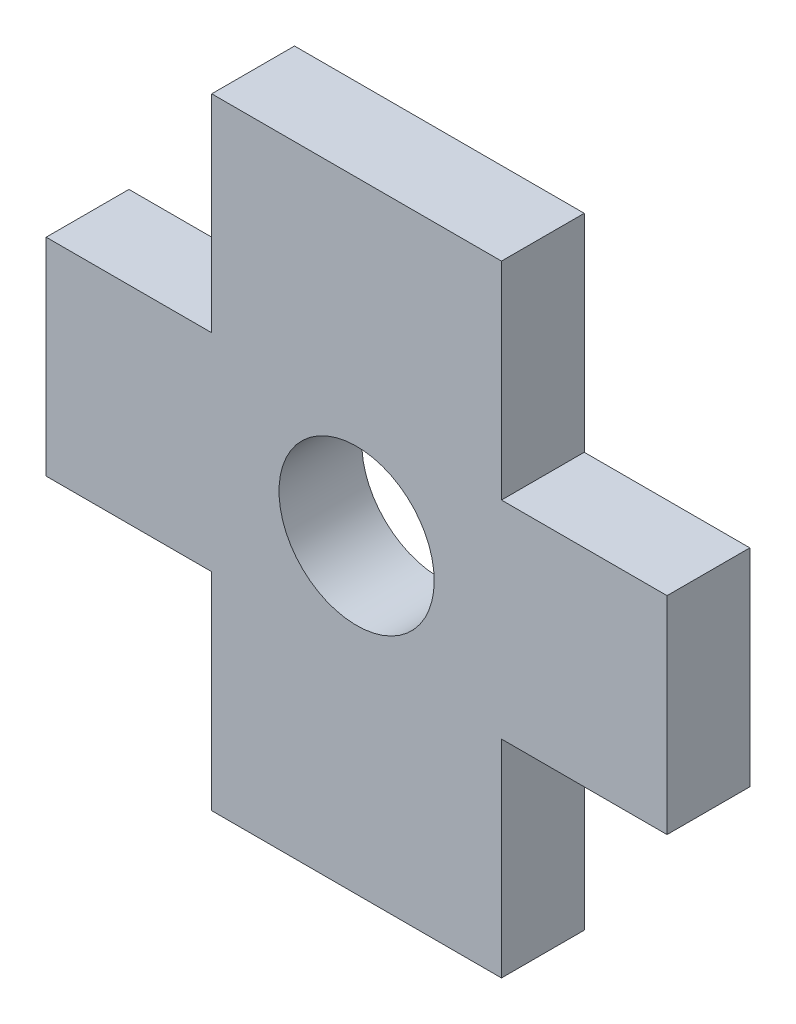
ISO-10303-21;
HEADER;
FILE_DESCRIPTION(('STEP AP214'),'2;1');
FILE_NAME('part.step','',(''),(''),'','','');
FILE_SCHEMA(('AUTOMOTIVE_DESIGN { 1 0 10303 214 1 1 1 1 }'));
ENDSEC;
DATA;
#1=APPLICATION_CONTEXT('core data for automotive mechanical design processes');
#2=APPLICATION_PROTOCOL_DEFINITION('international standard','automotive_design',2000,#1);
#3=PRODUCT_CONTEXT('',#1,'mechanical');
#4=PRODUCT('Part','Part','',(#3));
#5=PRODUCT_RELATED_PRODUCT_CATEGORY('part','',(#4));
#6=PRODUCT_DEFINITION_FORMATION('','',#4);
#7=PRODUCT_DEFINITION_CONTEXT('part definition',#1,'design');
#8=PRODUCT_DEFINITION('design','',#6,#7);
#9=PRODUCT_DEFINITION_SHAPE('','',#8);
#10=(LENGTH_UNIT() NAMED_UNIT(*) SI_UNIT(.MILLI.,.METRE.));
#11=(NAMED_UNIT(*) PLANE_ANGLE_UNIT() SI_UNIT($,.RADIAN.));
#12=(NAMED_UNIT(*) SI_UNIT($,.STERADIAN.) SOLID_ANGLE_UNIT());
#13=UNCERTAINTY_MEASURE_WITH_UNIT(LENGTH_MEASURE(1.E-05),#10,'distance_accuracy_value','');
#14=(GEOMETRIC_REPRESENTATION_CONTEXT(3) GLOBAL_UNCERTAINTY_ASSIGNED_CONTEXT((#13)) GLOBAL_UNIT_ASSIGNED_CONTEXT((#10,
#11,#12)) REPRESENTATION_CONTEXT('',''));
#15=CARTESIAN_POINT('',(0.,0.,0.));
#16=DIRECTION('',(0.,0.,1.));
#17=DIRECTION('',(1.,0.,0.));
#18=AXIS2_PLACEMENT_3D('',#15,#16,#17);
#19=CARTESIAN_POINT('',(0.,0.,1.6));
#20=DIRECTION('',(0.,0.,1.));
#21=DIRECTION('',(1.,0.,0.));
#22=AXIS2_PLACEMENT_3D('',#19,#20,#21);
#23=PLANE('',#22);
#24=DIRECTION('',(0.,-1.,0.));
#25=VECTOR('',#24,1.);
#26=CARTESIAN_POINT('',(-2.8,-2.,1.6));
#27=LINE('',#26,#25);
#28=CARTESIAN_POINT('',(-2.8,-2.,1.6));
#29=VERTEX_POINT('',#28);
#30=CARTESIAN_POINT('',(-2.8,-6.,1.6));
#31=VERTEX_POINT('',#30);
#32=EDGE_CURVE('E177',#29,#31,#27,.T.);
#33=ORIENTED_EDGE('',*,*,#32,.T.);
#34=DIRECTION('',(1.,0.,0.));
#35=VECTOR('',#34,1.);
#36=CARTESIAN_POINT('',(-2.8,-6.,1.6));
#37=LINE('',#36,#35);
#38=CARTESIAN_POINT('',(2.8,-6.,1.6));
#39=VERTEX_POINT('',#38);
#40=EDGE_CURVE('E105',#31,#39,#37,.T.);
#41=ORIENTED_EDGE('',*,*,#40,.T.);
#42=DIRECTION('',(0.,1.,0.));
#43=VECTOR('',#42,1.);
#44=CARTESIAN_POINT('',(2.8,-6.,1.6));
#45=LINE('',#44,#43);
#46=CARTESIAN_POINT('',(2.8,-2.,1.6));
#47=VERTEX_POINT('',#46);
#48=EDGE_CURVE('E204',#39,#47,#45,.T.);
#49=ORIENTED_EDGE('',*,*,#48,.T.);
#50=DIRECTION('',(1.,0.,0.));
#51=VECTOR('',#50,1.);
#52=CARTESIAN_POINT('',(2.8,-2.,1.6));
#53=LINE('',#52,#51);
#54=CARTESIAN_POINT('',(6.,-2.,1.6));
#55=VERTEX_POINT('',#54);
#56=EDGE_CURVE('E223',#47,#55,#53,.T.);
#57=ORIENTED_EDGE('',*,*,#56,.T.);
#58=DIRECTION('',(0.,1.,0.));
#59=VECTOR('',#58,1.);
#60=CARTESIAN_POINT('',(6.,-2.,1.6));
#61=LINE('',#60,#59);
#62=CARTESIAN_POINT('',(6.,2.,1.6));
#63=VERTEX_POINT('',#62);
#64=EDGE_CURVE('E220',#55,#63,#61,.T.);
#65=ORIENTED_EDGE('',*,*,#64,.T.);
#66=DIRECTION('',(-1.,0.,0.));
#67=VECTOR('',#66,1.);
#68=CARTESIAN_POINT('',(2.8,2.,1.6));
#69=LINE('',#68,#67);
#70=CARTESIAN_POINT('',(2.8,2.,1.6));
#71=VERTEX_POINT('',#70);
#72=EDGE_CURVE('E222',#63,#71,#69,.T.);
#73=ORIENTED_EDGE('',*,*,#72,.T.);
#74=DIRECTION('',(0.,1.,0.));
#75=VECTOR('',#74,1.);
#76=CARTESIAN_POINT('',(2.8,2.,1.6));
#77=LINE('',#76,#75);
#78=CARTESIAN_POINT('',(2.8,6.,1.6));
#79=VERTEX_POINT('',#78);
#80=EDGE_CURVE('E225',#71,#79,#77,.T.);
#81=ORIENTED_EDGE('',*,*,#80,.T.);
#82=DIRECTION('',(-1.,0.,0.));
#83=VECTOR('',#82,1.);
#84=CARTESIAN_POINT('',(2.8,6.,1.6));
#85=LINE('',#84,#83);
#86=CARTESIAN_POINT('',(-2.8,6.,1.6));
#87=VERTEX_POINT('',#86);
#88=EDGE_CURVE('E231',#79,#87,#85,.T.);
#89=ORIENTED_EDGE('',*,*,#88,.T.);
#90=DIRECTION('',(0.,-1.,0.));
#91=VECTOR('',#90,1.);
#92=CARTESIAN_POINT('',(-2.8,6.,1.6));
#93=LINE('',#92,#91);
#94=CARTESIAN_POINT('',(-2.8,2.,1.6));
#95=VERTEX_POINT('',#94);
#96=EDGE_CURVE('E136',#87,#95,#93,.T.);
#97=ORIENTED_EDGE('',*,*,#96,.T.);
#98=DIRECTION('',(-1.,0.,0.));
#99=VECTOR('',#98,1.);
#100=CARTESIAN_POINT('',(-2.8,2.,1.6));
#101=LINE('',#100,#99);
#102=CARTESIAN_POINT('',(-6.,2.,1.6));
#103=VERTEX_POINT('',#102);
#104=EDGE_CURVE('E130',#95,#103,#101,.T.);
#105=ORIENTED_EDGE('',*,*,#104,.T.);
#106=DIRECTION('',(0.,-1.,0.));
#107=VECTOR('',#106,1.);
#108=CARTESIAN_POINT('',(-6.,2.,1.6));
#109=LINE('',#108,#107);
#110=CARTESIAN_POINT('',(-6.,-2.,1.6));
#111=VERTEX_POINT('',#110);
#112=EDGE_CURVE('E134',#103,#111,#109,.T.);
#113=ORIENTED_EDGE('',*,*,#112,.T.);
#114=DIRECTION('',(1.,0.,0.));
#115=VECTOR('',#114,1.);
#116=CARTESIAN_POINT('',(-6.,-2.,1.6));
#117=LINE('',#116,#115);
#118=EDGE_CURVE('E50',#111,#29,#117,.T.);
#119=ORIENTED_EDGE('',*,*,#118,.T.);
#120=EDGE_LOOP('',(#33,#41,#49,#57,#65,#73,#81,#89,#97,#105,#113,#119));
#121=FACE_BOUND('',#120,.T.);
#122=CARTESIAN_POINT('',(0.,0.,1.6));
#123=DIRECTION('',(0.,0.,1.));
#124=DIRECTION('',(1.,0.,0.));
#125=AXIS2_PLACEMENT_3D('',#122,#123,#124);
#126=CIRCLE('',#125,1.5);
#127=CARTESIAN_POINT('',(1.5,0.,1.6));
#128=VERTEX_POINT('',#127);
#129=EDGE_CURVE('E158',#128,#128,#126,.T.);
#130=ORIENTED_EDGE('',*,*,#129,.F.);
#131=EDGE_LOOP('',(#130));
#132=FACE_BOUND('',#131,.T.);
#133=ADVANCED_FACE('F33',(#121,#132),#23,.T.);
#134=CARTESIAN_POINT('',(0.,0.,0.));
#135=DIRECTION('',(0.,0.,1.));
#136=DIRECTION('',(1.,0.,0.));
#137=AXIS2_PLACEMENT_3D('',#134,#135,#136);
#138=PLANE('',#137);
#139=DIRECTION('',(0.,-1.,0.));
#140=VECTOR('',#139,1.);
#141=CARTESIAN_POINT('',(-2.8,-2.,0.));
#142=LINE('',#141,#140);
#143=CARTESIAN_POINT('',(-2.8,-2.,0.));
#144=VERTEX_POINT('',#143);
#145=CARTESIAN_POINT('',(-2.8,-6.,0.));
#146=VERTEX_POINT('',#145);
#147=EDGE_CURVE('E154',#144,#146,#142,.T.);
#148=ORIENTED_EDGE('',*,*,#147,.F.);
#149=DIRECTION('',(1.,0.,0.));
#150=VECTOR('',#149,1.);
#151=CARTESIAN_POINT('',(-6.,-2.,0.));
#152=LINE('',#151,#150);
#153=CARTESIAN_POINT('',(-6.,-2.,0.));
#154=VERTEX_POINT('',#153);
#155=EDGE_CURVE('E97',#154,#144,#152,.T.);
#156=ORIENTED_EDGE('',*,*,#155,.F.);
#157=DIRECTION('',(0.,-1.,0.));
#158=VECTOR('',#157,1.);
#159=CARTESIAN_POINT('',(-6.,2.,0.));
#160=LINE('',#159,#158);
#161=CARTESIAN_POINT('',(-6.,2.,0.));
#162=VERTEX_POINT('',#161);
#163=EDGE_CURVE('E91',#162,#154,#160,.T.);
#164=ORIENTED_EDGE('',*,*,#163,.F.);
#165=DIRECTION('',(-1.,0.,0.));
#166=VECTOR('',#165,1.);
#167=CARTESIAN_POINT('',(-2.8,2.,0.));
#168=LINE('',#167,#166);
#169=CARTESIAN_POINT('',(-2.8,2.,0.));
#170=VERTEX_POINT('',#169);
#171=EDGE_CURVE('E144',#170,#162,#168,.T.);
#172=ORIENTED_EDGE('',*,*,#171,.F.);
#173=DIRECTION('',(0.,-1.,0.));
#174=VECTOR('',#173,1.);
#175=CARTESIAN_POINT('',(-2.8,6.,0.));
#176=LINE('',#175,#174);
#177=CARTESIAN_POINT('',(-2.8,6.,0.));
#178=VERTEX_POINT('',#177);
#179=EDGE_CURVE('E172',#178,#170,#176,.T.);
#180=ORIENTED_EDGE('',*,*,#179,.F.);
#181=DIRECTION('',(-1.,0.,0.));
#182=VECTOR('',#181,1.);
#183=CARTESIAN_POINT('',(2.8,6.,0.));
#184=LINE('',#183,#182);
#185=CARTESIAN_POINT('',(2.8,6.,0.));
#186=VERTEX_POINT('',#185);
#187=EDGE_CURVE('E170',#186,#178,#184,.T.);
#188=ORIENTED_EDGE('',*,*,#187,.F.);
#189=DIRECTION('',(0.,1.,0.));
#190=VECTOR('',#189,1.);
#191=CARTESIAN_POINT('',(2.8,2.,0.));
#192=LINE('',#191,#190);
#193=CARTESIAN_POINT('',(2.8,2.,0.));
#194=VERTEX_POINT('',#193);
#195=EDGE_CURVE('E168',#194,#186,#192,.T.);
#196=ORIENTED_EDGE('',*,*,#195,.F.);
#197=DIRECTION('',(-1.,0.,0.));
#198=VECTOR('',#197,1.);
#199=CARTESIAN_POINT('',(2.8,2.,0.));
#200=LINE('',#199,#198);
#201=CARTESIAN_POINT('',(6.,2.,0.));
#202=VERTEX_POINT('',#201);
#203=EDGE_CURVE('E166',#202,#194,#200,.T.);
#204=ORIENTED_EDGE('',*,*,#203,.F.);
#205=DIRECTION('',(0.,1.,0.));
#206=VECTOR('',#205,1.);
#207=CARTESIAN_POINT('',(6.,-2.,0.));
#208=LINE('',#207,#206);
#209=CARTESIAN_POINT('',(6.,-2.,0.));
#210=VERTEX_POINT('',#209);
#211=EDGE_CURVE('E164',#210,#202,#208,.T.);
#212=ORIENTED_EDGE('',*,*,#211,.F.);
#213=DIRECTION('',(1.,0.,0.));
#214=VECTOR('',#213,1.);
#215=CARTESIAN_POINT('',(2.8,-2.,0.));
#216=LINE('',#215,#214);
#217=CARTESIAN_POINT('',(2.8,-2.,0.));
#218=VERTEX_POINT('',#217);
#219=EDGE_CURVE('E162',#218,#210,#216,.T.);
#220=ORIENTED_EDGE('',*,*,#219,.F.);
#221=DIRECTION('',(0.,1.,0.));
#222=VECTOR('',#221,1.);
#223=CARTESIAN_POINT('',(2.8,-6.,0.));
#224=LINE('',#223,#222);
#225=CARTESIAN_POINT('',(2.8,-6.,0.));
#226=VERTEX_POINT('',#225);
#227=EDGE_CURVE('E160',#226,#218,#224,.T.);
#228=ORIENTED_EDGE('',*,*,#227,.F.);
#229=DIRECTION('',(1.,0.,0.));
#230=VECTOR('',#229,1.);
#231=CARTESIAN_POINT('',(-2.8,-6.,0.));
#232=LINE('',#231,#230);
#233=EDGE_CURVE('E157',#146,#226,#232,.T.);
#234=ORIENTED_EDGE('',*,*,#233,.F.);
#235=EDGE_LOOP('',(#148,#156,#164,#172,#180,#188,#196,#204,#212,#220,#228,#234));
#236=FACE_BOUND('',#235,.T.);
#237=CARTESIAN_POINT('',(0.,0.,0.));
#238=DIRECTION('',(0.,0.,1.));
#239=DIRECTION('',(1.,0.,0.));
#240=AXIS2_PLACEMENT_3D('',#237,#238,#239);
#241=CIRCLE('',#240,1.5);
#242=CARTESIAN_POINT('',(1.5,0.,0.));
#243=VERTEX_POINT('',#242);
#244=EDGE_CURVE('E378',#243,#243,#241,.T.);
#245=ORIENTED_EDGE('',*,*,#244,.T.);
#246=EDGE_LOOP('',(#245));
#247=FACE_BOUND('',#246,.T.);
#248=ADVANCED_FACE('F208',(#236,#247),#138,.F.);
#249=CARTESIAN_POINT('',(-2.8,-2.,1.6));
#250=DIRECTION('',(1.,0.,0.));
#251=DIRECTION('',(0.,1.,0.));
#252=AXIS2_PLACEMENT_3D('',#249,#250,#251);
#253=PLANE('',#252);
#254=ORIENTED_EDGE('',*,*,#147,.T.);
#255=DIRECTION('',(0.,0.,-1.));
#256=VECTOR('',#255,1.);
#257=CARTESIAN_POINT('',(-2.8,-6.,1.6));
#258=LINE('',#257,#256);
#259=EDGE_CURVE('E11',#31,#146,#258,.T.);
#260=ORIENTED_EDGE('',*,*,#259,.F.);
#261=ORIENTED_EDGE('',*,*,#32,.F.);
#262=DIRECTION('',(0.,0.,-1.));
#263=VECTOR('',#262,1.);
#264=CARTESIAN_POINT('',(-2.8,-2.,1.6));
#265=LINE('',#264,#263);
#266=EDGE_CURVE('E150',#29,#144,#265,.T.);
#267=ORIENTED_EDGE('',*,*,#266,.T.);
#268=EDGE_LOOP('',(#254,#260,#261,#267));
#269=FACE_BOUND('',#268,.T.);
#270=ADVANCED_FACE('F35',(#269),#253,.F.);
#271=CARTESIAN_POINT('',(-2.8,-6.,1.6));
#272=DIRECTION('',(0.,1.,0.));
#273=DIRECTION('',(0.,0.,1.));
#274=AXIS2_PLACEMENT_3D('',#271,#272,#273);
#275=PLANE('',#274);
#276=ORIENTED_EDGE('',*,*,#233,.T.);
#277=DIRECTION('',(0.,0.,-1.));
#278=VECTOR('',#277,1.);
#279=CARTESIAN_POINT('',(2.8,-6.,1.6));
#280=LINE('',#279,#278);
#281=EDGE_CURVE('E42',#39,#226,#280,.T.);
#282=ORIENTED_EDGE('',*,*,#281,.F.);
#283=ORIENTED_EDGE('',*,*,#40,.F.);
#284=ORIENTED_EDGE('',*,*,#259,.T.);
#285=EDGE_LOOP('',(#276,#282,#283,#284));
#286=FACE_BOUND('',#285,.T.);
#287=ADVANCED_FACE('F265',(#286),#275,.F.);
#288=CARTESIAN_POINT('',(2.8,-6.,1.6));
#289=DIRECTION('',(-1.,0.,0.));
#290=DIRECTION('',(0.,0.,1.));
#291=AXIS2_PLACEMENT_3D('',#288,#289,#290);
#292=PLANE('',#291);
#293=ORIENTED_EDGE('',*,*,#227,.T.);
#294=DIRECTION('',(0.,0.,-1.));
#295=VECTOR('',#294,1.);
#296=CARTESIAN_POINT('',(2.8,-2.,1.6));
#297=LINE('',#296,#295);
#298=EDGE_CURVE('E196',#47,#218,#297,.T.);
#299=ORIENTED_EDGE('',*,*,#298,.F.);
#300=ORIENTED_EDGE('',*,*,#48,.F.);
#301=ORIENTED_EDGE('',*,*,#281,.T.);
#302=EDGE_LOOP('',(#293,#299,#300,#301));
#303=FACE_BOUND('',#302,.T.);
#304=ADVANCED_FACE('F202',(#303),#292,.F.);
#305=CARTESIAN_POINT('',(2.8,-2.,1.6));
#306=DIRECTION('',(0.,1.,0.));
#307=DIRECTION('',(-1.,0.,0.));
#308=AXIS2_PLACEMENT_3D('',#305,#306,#307);
#309=PLANE('',#308);
#310=ORIENTED_EDGE('',*,*,#219,.T.);
#311=DIRECTION('',(0.,0.,-1.));
#312=VECTOR('',#311,1.);
#313=CARTESIAN_POINT('',(6.,-2.,1.6));
#314=LINE('',#313,#312);
#315=EDGE_CURVE('E193',#55,#210,#314,.T.);
#316=ORIENTED_EDGE('',*,*,#315,.F.);
#317=ORIENTED_EDGE('',*,*,#56,.F.);
#318=ORIENTED_EDGE('',*,*,#298,.T.);
#319=EDGE_LOOP('',(#310,#316,#317,#318));
#320=FACE_BOUND('',#319,.T.);
#321=ADVANCED_FACE('F214',(#320),#309,.F.);
#322=CARTESIAN_POINT('',(6.,-2.,1.6));
#323=DIRECTION('',(-1.,0.,0.));
#324=DIRECTION('',(0.,0.,1.));
#325=AXIS2_PLACEMENT_3D('',#322,#323,#324);
#326=PLANE('',#325);
#327=ORIENTED_EDGE('',*,*,#211,.T.);
#328=DIRECTION('',(0.,0.,-1.));
#329=VECTOR('',#328,1.);
#330=CARTESIAN_POINT('',(6.,2.,1.6));
#331=LINE('',#330,#329);
#332=EDGE_CURVE('E190',#63,#202,#331,.T.);
#333=ORIENTED_EDGE('',*,*,#332,.F.);
#334=ORIENTED_EDGE('',*,*,#64,.F.);
#335=ORIENTED_EDGE('',*,*,#315,.T.);
#336=EDGE_LOOP('',(#327,#333,#334,#335));
#337=FACE_BOUND('',#336,.T.);
#338=ADVANCED_FACE('F218',(#337),#326,.F.);
#339=CARTESIAN_POINT('',(2.8,2.,1.6));
#340=DIRECTION('',(0.,-1.,0.));
#341=DIRECTION('',(1.,0.,0.));
#342=AXIS2_PLACEMENT_3D('',#339,#340,#341);
#343=PLANE('',#342);
#344=ORIENTED_EDGE('',*,*,#203,.T.);
#345=DIRECTION('',(0.,0.,-1.));
#346=VECTOR('',#345,1.);
#347=CARTESIAN_POINT('',(2.8,2.,1.6));
#348=LINE('',#347,#346);
#349=EDGE_CURVE('E187',#71,#194,#348,.T.);
#350=ORIENTED_EDGE('',*,*,#349,.F.);
#351=ORIENTED_EDGE('',*,*,#72,.F.);
#352=ORIENTED_EDGE('',*,*,#332,.T.);
#353=EDGE_LOOP('',(#344,#350,#351,#352));
#354=FACE_BOUND('',#353,.T.);
#355=ADVANCED_FACE('F278',(#354),#343,.F.);
#356=CARTESIAN_POINT('',(2.8,2.,1.6));
#357=DIRECTION('',(-1.,0.,0.));
#358=DIRECTION('',(0.,0.,1.));
#359=AXIS2_PLACEMENT_3D('',#356,#357,#358);
#360=PLANE('',#359);
#361=ORIENTED_EDGE('',*,*,#195,.T.);
#362=DIRECTION('',(0.,0.,-1.));
#363=VECTOR('',#362,1.);
#364=CARTESIAN_POINT('',(2.8,6.,1.6));
#365=LINE('',#364,#363);
#366=EDGE_CURVE('E184',#79,#186,#365,.T.);
#367=ORIENTED_EDGE('',*,*,#366,.F.);
#368=ORIENTED_EDGE('',*,*,#80,.F.);
#369=ORIENTED_EDGE('',*,*,#349,.T.);
#370=EDGE_LOOP('',(#361,#367,#368,#369));
#371=FACE_BOUND('',#370,.T.);
#372=ADVANCED_FACE('F281',(#371),#360,.F.);
#373=CARTESIAN_POINT('',(2.8,6.,1.6));
#374=DIRECTION('',(0.,-1.,0.));
#375=DIRECTION('',(1.,0.,0.));
#376=AXIS2_PLACEMENT_3D('',#373,#374,#375);
#377=PLANE('',#376);
#378=ORIENTED_EDGE('',*,*,#187,.T.);
#379=DIRECTION('',(0.,0.,-1.));
#380=VECTOR('',#379,1.);
#381=CARTESIAN_POINT('',(-2.8,6.,1.6));
#382=LINE('',#381,#380);
#383=EDGE_CURVE('E181',#87,#178,#382,.T.);
#384=ORIENTED_EDGE('',*,*,#383,.F.);
#385=ORIENTED_EDGE('',*,*,#88,.F.);
#386=ORIENTED_EDGE('',*,*,#366,.T.);
#387=EDGE_LOOP('',(#378,#384,#385,#386));
#388=FACE_BOUND('',#387,.T.);
#389=ADVANCED_FACE('F237',(#388),#377,.F.);
#390=CARTESIAN_POINT('',(-2.8,6.,1.6));
#391=DIRECTION('',(1.,0.,0.));
#392=DIRECTION('',(0.,1.,0.));
#393=AXIS2_PLACEMENT_3D('',#390,#391,#392);
#394=PLANE('',#393);
#395=ORIENTED_EDGE('',*,*,#179,.T.);
#396=DIRECTION('',(0.,0.,-1.));
#397=VECTOR('',#396,1.);
#398=CARTESIAN_POINT('',(-2.8,2.,1.6));
#399=LINE('',#398,#397);
#400=EDGE_CURVE('E145',#95,#170,#399,.T.);
#401=ORIENTED_EDGE('',*,*,#400,.F.);
#402=ORIENTED_EDGE('',*,*,#96,.F.);
#403=ORIENTED_EDGE('',*,*,#383,.T.);
#404=EDGE_LOOP('',(#395,#401,#402,#403));
#405=FACE_BOUND('',#404,.T.);
#406=ADVANCED_FACE('F241',(#405),#394,.F.);
#407=CARTESIAN_POINT('',(-2.8,2.,1.6));
#408=DIRECTION('',(0.,-1.,0.));
#409=DIRECTION('',(1.,0.,0.));
#410=AXIS2_PLACEMENT_3D('',#407,#408,#409);
#411=PLANE('',#410);
#412=ORIENTED_EDGE('',*,*,#171,.T.);
#413=DIRECTION('',(0.,0.,-1.));
#414=VECTOR('',#413,1.);
#415=CARTESIAN_POINT('',(-6.,2.,1.6));
#416=LINE('',#415,#414);
#417=EDGE_CURVE('E141',#103,#162,#416,.T.);
#418=ORIENTED_EDGE('',*,*,#417,.F.);
#419=ORIENTED_EDGE('',*,*,#104,.F.);
#420=ORIENTED_EDGE('',*,*,#400,.T.);
#421=EDGE_LOOP('',(#412,#418,#419,#420));
#422=FACE_BOUND('',#421,.T.);
#423=ADVANCED_FACE('F142',(#422),#411,.F.);
#424=CARTESIAN_POINT('',(-6.,2.,1.6));
#425=DIRECTION('',(1.,0.,0.));
#426=DIRECTION('',(0.,1.,0.));
#427=AXIS2_PLACEMENT_3D('',#424,#425,#426);
#428=PLANE('',#427);
#429=ORIENTED_EDGE('',*,*,#163,.T.);
#430=DIRECTION('',(0.,0.,-1.));
#431=VECTOR('',#430,1.);
#432=CARTESIAN_POINT('',(-6.,-2.,1.6));
#433=LINE('',#432,#431);
#434=EDGE_CURVE('E146',#111,#154,#433,.T.);
#435=ORIENTED_EDGE('',*,*,#434,.F.);
#436=ORIENTED_EDGE('',*,*,#112,.F.);
#437=ORIENTED_EDGE('',*,*,#417,.T.);
#438=EDGE_LOOP('',(#429,#435,#436,#437));
#439=FACE_BOUND('',#438,.T.);
#440=ADVANCED_FACE('F148',(#439),#428,.F.);
#441=CARTESIAN_POINT('',(-6.,-2.,1.6));
#442=DIRECTION('',(0.,1.,0.));
#443=DIRECTION('',(0.,0.,1.));
#444=AXIS2_PLACEMENT_3D('',#441,#442,#443);
#445=PLANE('',#444);
#446=ORIENTED_EDGE('',*,*,#155,.T.);
#447=ORIENTED_EDGE('',*,*,#266,.F.);
#448=ORIENTED_EDGE('',*,*,#118,.F.);
#449=ORIENTED_EDGE('',*,*,#434,.T.);
#450=EDGE_LOOP('',(#446,#447,#448,#449));
#451=FACE_BOUND('',#450,.T.);
#452=ADVANCED_FACE('F245',(#451),#445,.F.);
#453=CARTESIAN_POINT('',(0.,0.,1.6));
#454=DIRECTION('',(0.,0.,-1.));
#455=DIRECTION('',(-1.,0.,0.));
#456=AXIS2_PLACEMENT_3D('',#453,#454,#455);
#457=CYLINDRICAL_SURFACE('',#456,1.5);
#458=ORIENTED_EDGE('',*,*,#129,.T.);
#459=EDGE_LOOP('',(#458));
#460=FACE_BOUND('',#459,.T.);
#461=ORIENTED_EDGE('',*,*,#244,.F.);
#462=EDGE_LOOP('',(#461));
#463=FACE_BOUND('',#462,.T.);
#464=ADVANCED_FACE('F247',(#460,#463),#457,.F.);
#465=CLOSED_SHELL('',(#133,#248,#270,#287,#304,#321,#338,#355,#372,#389,#406,#423,#440,#452,#464));
#466=MANIFOLD_SOLID_BREP('B2',#465);
#467=ADVANCED_BREP_SHAPE_REPRESENTATION('',(#18,#466),#14);
#468=SHAPE_DEFINITION_REPRESENTATION(#9,#467);
ENDSEC;
END-ISO-10303-21;
